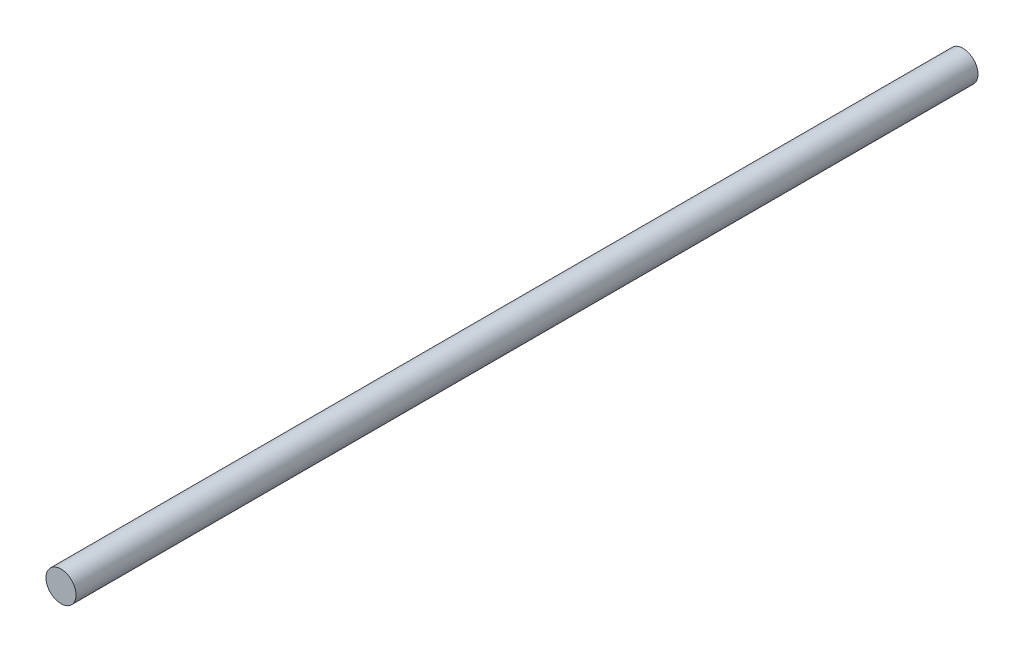
ISO-10303-21;
HEADER;
FILE_DESCRIPTION(('STEP AP214'),'2;1');
FILE_NAME('part.step','',(''),(''),'','','');
FILE_SCHEMA(('AUTOMOTIVE_DESIGN { 1 0 10303 214 1 1 1 1 }'));
ENDSEC;
DATA;
#1=APPLICATION_CONTEXT('core data for automotive mechanical design processes');
#2=APPLICATION_PROTOCOL_DEFINITION('international standard','automotive_design',2000,#1);
#3=PRODUCT_CONTEXT('',#1,'mechanical');
#4=PRODUCT('Part','Part','',(#3));
#5=PRODUCT_RELATED_PRODUCT_CATEGORY('part','',(#4));
#6=PRODUCT_DEFINITION_FORMATION('','',#4);
#7=PRODUCT_DEFINITION_CONTEXT('part definition',#1,'design');
#8=PRODUCT_DEFINITION('design','',#6,#7);
#9=PRODUCT_DEFINITION_SHAPE('','',#8);
#10=(LENGTH_UNIT() NAMED_UNIT(*) SI_UNIT(.MILLI.,.METRE.));
#11=(NAMED_UNIT(*) PLANE_ANGLE_UNIT() SI_UNIT($,.RADIAN.));
#12=(NAMED_UNIT(*) SI_UNIT($,.STERADIAN.) SOLID_ANGLE_UNIT());
#13=UNCERTAINTY_MEASURE_WITH_UNIT(LENGTH_MEASURE(1.E-05),#10,'distance_accuracy_value','');
#14=(GEOMETRIC_REPRESENTATION_CONTEXT(3) GLOBAL_UNCERTAINTY_ASSIGNED_CONTEXT((#13)) GLOBAL_UNIT_ASSIGNED_CONTEXT((#10,
#11,#12)) REPRESENTATION_CONTEXT('',''));
#15=CARTESIAN_POINT('',(0.,0.,0.));
#16=DIRECTION('',(0.,0.,1.));
#17=DIRECTION('',(1.,0.,0.));
#18=AXIS2_PLACEMENT_3D('',#15,#16,#17);
#19=CARTESIAN_POINT('',(0.,0.,120.));
#20=DIRECTION('',(0.,0.,-1.));
#21=DIRECTION('',(-1.,0.,0.));
#22=AXIS2_PLACEMENT_3D('',#19,#20,#21);
#23=CYLINDRICAL_SURFACE('',#22,2.);
#24=CARTESIAN_POINT('',(0.,0.,120.));
#25=DIRECTION('',(0.,0.,1.));
#26=DIRECTION('',(1.,0.,0.));
#27=AXIS2_PLACEMENT_3D('',#24,#25,#26);
#28=CIRCLE('',#27,2.);
#29=CARTESIAN_POINT('',(2.,0.,120.));
#30=VERTEX_POINT('',#29);
#31=EDGE_CURVE('E10',#30,#30,#28,.T.);
#32=ORIENTED_EDGE('',*,*,#31,.F.);
#33=EDGE_LOOP('',(#32));
#34=FACE_BOUND('',#33,.T.);
#35=CARTESIAN_POINT('',(0.,0.,0.));
#36=DIRECTION('',(0.,0.,1.));
#37=DIRECTION('',(1.,0.,0.));
#38=AXIS2_PLACEMENT_3D('',#35,#36,#37);
#39=CIRCLE('',#38,2.);
#40=CARTESIAN_POINT('',(2.,0.,0.));
#41=VERTEX_POINT('',#40);
#42=EDGE_CURVE('E36',#41,#41,#39,.T.);
#43=ORIENTED_EDGE('',*,*,#42,.T.);
#44=EDGE_LOOP('',(#43));
#45=FACE_BOUND('',#44,.T.);
#46=ADVANCED_FACE('F33',(#34,#45),#23,.T.);
#47=CARTESIAN_POINT('',(0.,0.,120.));
#48=DIRECTION('',(0.,0.,1.));
#49=DIRECTION('',(1.,0.,0.));
#50=AXIS2_PLACEMENT_3D('',#47,#48,#49);
#51=PLANE('',#50);
#52=ORIENTED_EDGE('',*,*,#31,.T.);
#53=EDGE_LOOP('',(#52));
#54=FACE_BOUND('',#53,.T.);
#55=ADVANCED_FACE('F48',(#54),#51,.T.);
#56=CARTESIAN_POINT('',(0.,0.,0.));
#57=DIRECTION('',(0.,0.,1.));
#58=DIRECTION('',(1.,0.,0.));
#59=AXIS2_PLACEMENT_3D('',#56,#57,#58);
#60=PLANE('',#59);
#61=ORIENTED_EDGE('',*,*,#42,.F.);
#62=EDGE_LOOP('',(#61));
#63=FACE_BOUND('',#62,.T.);
#64=ADVANCED_FACE('F46',(#63),#60,.F.);
#65=CLOSED_SHELL('',(#46,#55,#64));
#66=MANIFOLD_SOLID_BREP('B2',#65);
#67=ADVANCED_BREP_SHAPE_REPRESENTATION('',(#18,#66),#14);
#68=SHAPE_DEFINITION_REPRESENTATION(#9,#67);
ENDSEC;
END-ISO-10303-21;
